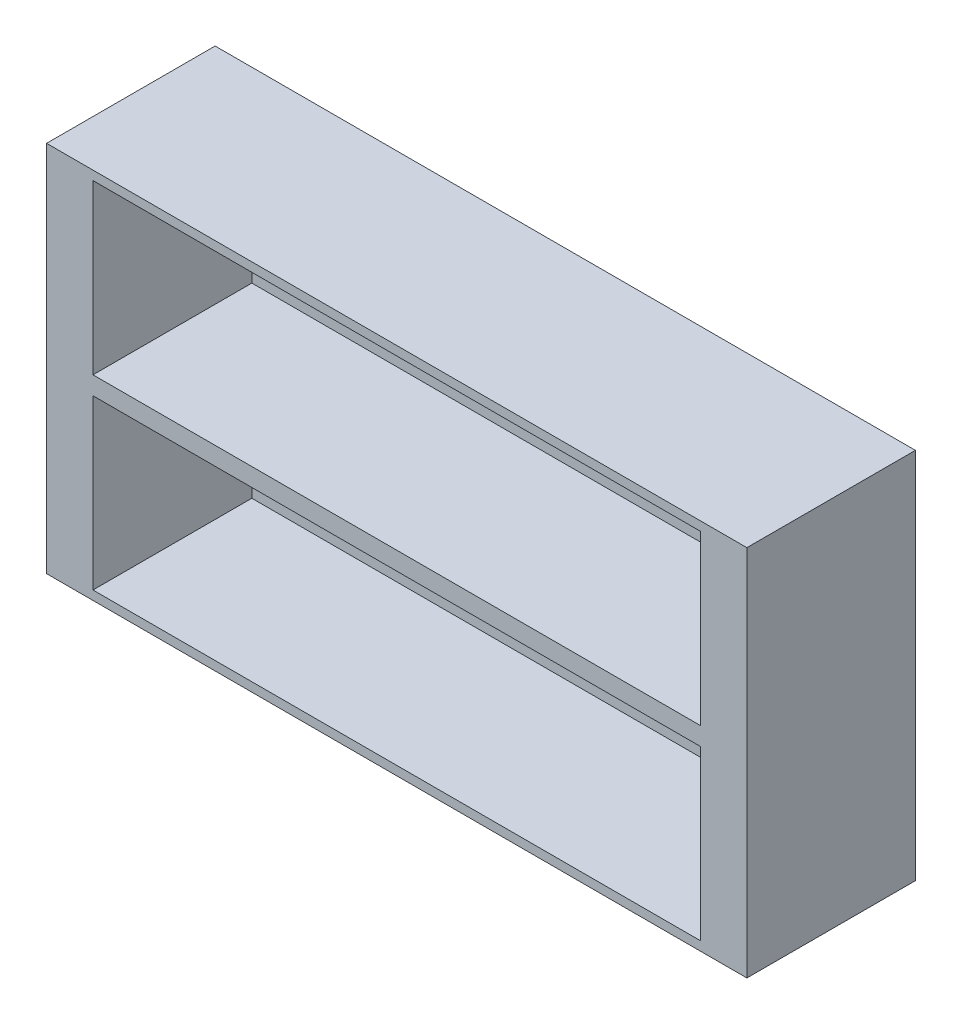
ISO-10303-21;
HEADER;
FILE_DESCRIPTION(('STEP AP214'),'2;1');
FILE_NAME('part.step','',(''),(''),'','','');
FILE_SCHEMA(('AUTOMOTIVE_DESIGN { 1 0 10303 214 1 1 1 1 }'));
ENDSEC;
DATA;
#1=APPLICATION_CONTEXT('core data for automotive mechanical design processes');
#2=APPLICATION_PROTOCOL_DEFINITION('international standard','automotive_design',2000,#1);
#3=PRODUCT_CONTEXT('',#1,'mechanical');
#4=PRODUCT('Part','Part','',(#3));
#5=PRODUCT_RELATED_PRODUCT_CATEGORY('part','',(#4));
#6=PRODUCT_DEFINITION_FORMATION('','',#4);
#7=PRODUCT_DEFINITION_CONTEXT('part definition',#1,'design');
#8=PRODUCT_DEFINITION('design','',#6,#7);
#9=PRODUCT_DEFINITION_SHAPE('','',#8);
#10=(LENGTH_UNIT() NAMED_UNIT(*) SI_UNIT(.MILLI.,.METRE.));
#11=(NAMED_UNIT(*) PLANE_ANGLE_UNIT() SI_UNIT($,.RADIAN.));
#12=(NAMED_UNIT(*) SI_UNIT($,.STERADIAN.) SOLID_ANGLE_UNIT());
#13=UNCERTAINTY_MEASURE_WITH_UNIT(LENGTH_MEASURE(1.E-05),#10,'distance_accuracy_value','');
#14=(GEOMETRIC_REPRESENTATION_CONTEXT(3) GLOBAL_UNCERTAINTY_ASSIGNED_CONTEXT((#13)) GLOBAL_UNIT_ASSIGNED_CONTEXT((#10,
#11,#12)) REPRESENTATION_CONTEXT('',''));
#15=CARTESIAN_POINT('',(0.,0.,0.));
#16=DIRECTION('',(0.,0.,1.));
#17=DIRECTION('',(1.,0.,0.));
#18=AXIS2_PLACEMENT_3D('',#15,#16,#17);
#19=CARTESIAN_POINT('',(0.,9.9695,0.));
#20=DIRECTION('',(0.,0.,1.));
#21=DIRECTION('',(1.,0.,0.));
#22=AXIS2_PLACEMENT_3D('',#19,#20,#21);
#23=CYLINDRICAL_SURFACE('',#22,1.5);
#24=CARTESIAN_POINT('',(0.,9.9695,0.));
#25=DIRECTION('',(0.,0.,1.));
#26=DIRECTION('',(-1.,0.,0.));
#27=AXIS2_PLACEMENT_3D('',#24,#25,#26);
#28=CIRCLE('',#27,1.5);
#29=CARTESIAN_POINT('',(-1.5,9.9695,0.));
#30=VERTEX_POINT('',#29);
#31=EDGE_CURVE('E199',#30,#30,#28,.T.);
#32=ORIENTED_EDGE('',*,*,#31,.F.);
#33=EDGE_LOOP('',(#32));
#34=FACE_BOUND('',#33,.T.);
#35=CARTESIAN_POINT('',(0.,9.9695,1.034));
#36=DIRECTION('',(0.,0.,1.));
#37=DIRECTION('',(1.,0.,0.));
#38=AXIS2_PLACEMENT_3D('',#35,#36,#37);
#39=CIRCLE('',#38,1.5);
#40=CARTESIAN_POINT('',(1.5,9.9695,1.034));
#41=VERTEX_POINT('',#40);
#42=EDGE_CURVE('E38',#41,#41,#39,.F.);
#43=ORIENTED_EDGE('',*,*,#42,.F.);
#44=EDGE_LOOP('',(#43));
#45=FACE_BOUND('',#44,.T.);
#46=ADVANCED_FACE('F34',(#34,#45),#23,.F.);
#47=CARTESIAN_POINT('',(37.465,-19.939,18.034));
#48=DIRECTION('',(-1.,0.,0.));
#49=DIRECTION('',(0.,0.,1.));
#50=AXIS2_PLACEMENT_3D('',#47,#48,#49);
#51=PLANE('',#50);
#52=DIRECTION('',(0.,1.,0.));
#53=VECTOR('',#52,1.);
#54=CARTESIAN_POINT('',(37.465,-19.939,0.));
#55=LINE('',#54,#53);
#56=CARTESIAN_POINT('',(37.465,-19.939,0.));
#57=VERTEX_POINT('',#56);
#58=CARTESIAN_POINT('',(37.465,19.939,0.));
#59=VERTEX_POINT('',#58);
#60=EDGE_CURVE('E198',#57,#59,#55,.T.);
#61=ORIENTED_EDGE('',*,*,#60,.T.);
#62=DIRECTION('',(0.,0.,-1.));
#63=VECTOR('',#62,1.);
#64=CARTESIAN_POINT('',(37.465,19.939,18.034));
#65=LINE('',#64,#63);
#66=CARTESIAN_POINT('',(37.465,19.939,18.034));
#67=VERTEX_POINT('',#66);
#68=EDGE_CURVE('E11',#67,#59,#65,.T.);
#69=ORIENTED_EDGE('',*,*,#68,.F.);
#70=DIRECTION('',(0.,1.,0.));
#71=VECTOR('',#70,1.);
#72=CARTESIAN_POINT('',(37.465,-19.939,18.034));
#73=LINE('',#72,#71);
#74=CARTESIAN_POINT('',(37.465,-19.939,18.034));
#75=VERTEX_POINT('',#74);
#76=EDGE_CURVE('E202',#75,#67,#73,.T.);
#77=ORIENTED_EDGE('',*,*,#76,.F.);
#78=DIRECTION('',(0.,0.,-1.));
#79=VECTOR('',#78,1.);
#80=CARTESIAN_POINT('',(37.465,-19.939,18.034));
#81=LINE('',#80,#79);
#82=EDGE_CURVE('E212',#75,#57,#81,.T.);
#83=ORIENTED_EDGE('',*,*,#82,.T.);
#84=EDGE_LOOP('',(#61,#69,#77,#83));
#85=FACE_BOUND('',#84,.T.);
#86=ADVANCED_FACE('F36',(#85),#51,.F.);
#87=CARTESIAN_POINT('',(-37.465,19.939,18.034));
#88=DIRECTION('',(0.,-1.,0.));
#89=DIRECTION('',(0.,0.,-1.));
#90=AXIS2_PLACEMENT_3D('',#87,#88,#89);
#91=PLANE('',#90);
#92=DIRECTION('',(-1.,0.,0.));
#93=VECTOR('',#92,1.);
#94=CARTESIAN_POINT('',(-37.465,19.939,0.));
#95=LINE('',#94,#93);
#96=CARTESIAN_POINT('',(-37.465,19.939,0.));
#97=VERTEX_POINT('',#96);
#98=EDGE_CURVE('E215',#59,#97,#95,.T.);
#99=ORIENTED_EDGE('',*,*,#98,.T.);
#100=DIRECTION('',(0.,0.,-1.));
#101=VECTOR('',#100,1.);
#102=CARTESIAN_POINT('',(-37.465,19.939,18.034));
#103=LINE('',#102,#101);
#104=CARTESIAN_POINT('',(-37.465,19.939,18.034));
#105=VERTEX_POINT('',#104);
#106=EDGE_CURVE('E43',#105,#97,#103,.T.);
#107=ORIENTED_EDGE('',*,*,#106,.F.);
#108=DIRECTION('',(-1.,0.,0.));
#109=VECTOR('',#108,1.);
#110=CARTESIAN_POINT('',(-37.465,19.939,18.034));
#111=LINE('',#110,#109);
#112=EDGE_CURVE('E205',#67,#105,#111,.T.);
#113=ORIENTED_EDGE('',*,*,#112,.F.);
#114=ORIENTED_EDGE('',*,*,#68,.T.);
#115=EDGE_LOOP('',(#99,#107,#113,#114));
#116=FACE_BOUND('',#115,.T.);
#117=ADVANCED_FACE('F238',(#116),#91,.F.);
#118=CARTESIAN_POINT('',(-37.465,-19.939,18.034));
#119=DIRECTION('',(1.,0.,0.));
#120=DIRECTION('',(0.,0.,-1.));
#121=AXIS2_PLACEMENT_3D('',#118,#119,#120);
#122=PLANE('',#121);
#123=DIRECTION('',(0.,-1.,0.));
#124=VECTOR('',#123,1.);
#125=CARTESIAN_POINT('',(-37.465,-19.939,0.));
#126=LINE('',#125,#124);
#127=CARTESIAN_POINT('',(-37.465,-19.939,0.));
#128=VERTEX_POINT('',#127);
#129=EDGE_CURVE('E217',#97,#128,#126,.T.);
#130=ORIENTED_EDGE('',*,*,#129,.T.);
#131=DIRECTION('',(0.,0.,-1.));
#132=VECTOR('',#131,1.);
#133=CARTESIAN_POINT('',(-37.465,-19.939,18.034));
#134=LINE('',#133,#132);
#135=CARTESIAN_POINT('',(-37.465,-19.939,18.034));
#136=VERTEX_POINT('',#135);
#137=EDGE_CURVE('E222',#136,#128,#134,.T.);
#138=ORIENTED_EDGE('',*,*,#137,.F.);
#139=DIRECTION('',(0.,-1.,0.));
#140=VECTOR('',#139,1.);
#141=CARTESIAN_POINT('',(-37.465,-19.939,18.034));
#142=LINE('',#141,#140);
#143=EDGE_CURVE('E208',#105,#136,#142,.T.);
#144=ORIENTED_EDGE('',*,*,#143,.F.);
#145=ORIENTED_EDGE('',*,*,#106,.T.);
#146=EDGE_LOOP('',(#130,#138,#144,#145));
#147=FACE_BOUND('',#146,.T.);
#148=ADVANCED_FACE('F256',(#147),#122,.F.);
#149=CARTESIAN_POINT('',(-37.465,-19.939,18.034));
#150=DIRECTION('',(0.,1.,0.));
#151=DIRECTION('',(0.,0.,1.));
#152=AXIS2_PLACEMENT_3D('',#149,#150,#151);
#153=PLANE('',#152);
#154=DIRECTION('',(1.,0.,0.));
#155=VECTOR('',#154,1.);
#156=CARTESIAN_POINT('',(-37.465,-19.939,0.));
#157=LINE('',#156,#155);
#158=EDGE_CURVE('E206',#128,#57,#157,.T.);
#159=ORIENTED_EDGE('',*,*,#158,.T.);
#160=ORIENTED_EDGE('',*,*,#82,.F.);
#161=DIRECTION('',(1.,0.,0.));
#162=VECTOR('',#161,1.);
#163=CARTESIAN_POINT('',(-37.465,-19.939,18.034));
#164=LINE('',#163,#162);
#165=EDGE_CURVE('E210',#136,#75,#164,.T.);
#166=ORIENTED_EDGE('',*,*,#165,.F.);
#167=ORIENTED_EDGE('',*,*,#137,.T.);
#168=EDGE_LOOP('',(#159,#160,#166,#167));
#169=FACE_BOUND('',#168,.T.);
#170=ADVANCED_FACE('F249',(#169),#153,.F.);
#171=CARTESIAN_POINT('',(0.,0.,18.034));
#172=DIRECTION('',(0.,0.,-1.));
#173=DIRECTION('',(-1.,0.,0.));
#174=AXIS2_PLACEMENT_3D('',#171,#172,#173);
#175=PLANE('',#174);
#176=DIRECTION('',(1.,0.,0.));
#177=VECTOR('',#176,1.);
#178=CARTESIAN_POINT('',(32.5,0.969500000000008,18.034));
#179=LINE('',#178,#177);
#180=CARTESIAN_POINT('',(-32.5,0.9695,18.034));
#181=VERTEX_POINT('',#180);
#182=CARTESIAN_POINT('',(32.5,0.969500000000008,18.034));
#183=VERTEX_POINT('',#182);
#184=EDGE_CURVE('E155',#181,#183,#179,.T.);
#185=ORIENTED_EDGE('',*,*,#184,.F.);
#186=DIRECTION('',(0.,-1.,0.));
#187=VECTOR('',#186,1.);
#188=CARTESIAN_POINT('',(-32.5,0.9695,18.034));
#189=LINE('',#188,#187);
#190=CARTESIAN_POINT('',(-32.5,18.9695,18.034));
#191=VERTEX_POINT('',#190);
#192=EDGE_CURVE('E51',#191,#181,#189,.T.);
#193=ORIENTED_EDGE('',*,*,#192,.F.);
#194=DIRECTION('',(-1.,0.,0.));
#195=VECTOR('',#194,1.);
#196=CARTESIAN_POINT('',(32.5,18.9695,18.034));
#197=LINE('',#196,#195);
#198=CARTESIAN_POINT('',(32.5,18.9695,18.034));
#199=VERTEX_POINT('',#198);
#200=EDGE_CURVE('E146',#199,#191,#197,.T.);
#201=ORIENTED_EDGE('',*,*,#200,.F.);
#202=DIRECTION('',(0.,1.,0.));
#203=VECTOR('',#202,1.);
#204=CARTESIAN_POINT('',(32.5,0.969500000000008,18.034));
#205=LINE('',#204,#203);
#206=EDGE_CURVE('E149',#183,#199,#205,.T.);
#207=ORIENTED_EDGE('',*,*,#206,.F.);
#208=EDGE_LOOP('',(#185,#193,#201,#207));
#209=FACE_BOUND('',#208,.T.);
#210=DIRECTION('',(-1.,0.,0.));
#211=VECTOR('',#210,1.);
#212=CARTESIAN_POINT('',(32.5,-0.969500000000008,18.034));
#213=LINE('',#212,#211);
#214=CARTESIAN_POINT('',(32.5,-0.969500000000008,18.034));
#215=VERTEX_POINT('',#214);
#216=CARTESIAN_POINT('',(-32.5,-0.9695,18.034));
#217=VERTEX_POINT('',#216);
#218=EDGE_CURVE('E181',#215,#217,#213,.T.);
#219=ORIENTED_EDGE('',*,*,#218,.F.);
#220=DIRECTION('',(0.,1.,0.));
#221=VECTOR('',#220,1.);
#222=CARTESIAN_POINT('',(32.5,-0.969500000000008,18.034));
#223=LINE('',#222,#221);
#224=CARTESIAN_POINT('',(32.5,-18.9695,18.034));
#225=VERTEX_POINT('',#224);
#226=EDGE_CURVE('E59',#225,#215,#223,.T.);
#227=ORIENTED_EDGE('',*,*,#226,.F.);
#228=DIRECTION('',(1.,0.,0.));
#229=VECTOR('',#228,1.);
#230=CARTESIAN_POINT('',(32.5,-18.9695,18.034));
#231=LINE('',#230,#229);
#232=CARTESIAN_POINT('',(-32.5,-18.9695,18.034));
#233=VERTEX_POINT('',#232);
#234=EDGE_CURVE('E170',#233,#225,#231,.T.);
#235=ORIENTED_EDGE('',*,*,#234,.F.);
#236=DIRECTION('',(0.,-1.,0.));
#237=VECTOR('',#236,1.);
#238=CARTESIAN_POINT('',(-32.5,-0.9695,18.034));
#239=LINE('',#238,#237);
#240=EDGE_CURVE('E184',#217,#233,#239,.T.);
#241=ORIENTED_EDGE('',*,*,#240,.F.);
#242=EDGE_LOOP('',(#219,#227,#235,#241));
#243=FACE_BOUND('',#242,.T.);
#244=ORIENTED_EDGE('',*,*,#76,.T.);
#245=ORIENTED_EDGE('',*,*,#112,.T.);
#246=ORIENTED_EDGE('',*,*,#143,.T.);
#247=ORIENTED_EDGE('',*,*,#165,.T.);
#248=EDGE_LOOP('',(#244,#245,#246,#247));
#249=FACE_BOUND('',#248,.T.);
#250=ADVANCED_FACE('F245',(#209,#243,#249),#175,.F.);
#251=CARTESIAN_POINT('',(0.,0.,0.));
#252=DIRECTION('',(0.,0.,-1.));
#253=DIRECTION('',(-1.,0.,0.));
#254=AXIS2_PLACEMENT_3D('',#251,#252,#253);
#255=PLANE('',#254);
#256=CARTESIAN_POINT('',(0.,-9.9695,0.));
#257=DIRECTION('',(0.,0.,1.));
#258=DIRECTION('',(1.,0.,0.));
#259=AXIS2_PLACEMENT_3D('',#256,#257,#258);
#260=CIRCLE('',#259,1.5);
#261=CARTESIAN_POINT('',(1.5,-9.9695,0.));
#262=VERTEX_POINT('',#261);
#263=EDGE_CURVE('E195',#262,#262,#260,.T.);
#264=ORIENTED_EDGE('',*,*,#263,.T.);
#265=EDGE_LOOP('',(#264));
#266=FACE_BOUND('',#265,.T.);
#267=ORIENTED_EDGE('',*,*,#31,.T.);
#268=EDGE_LOOP('',(#267));
#269=FACE_BOUND('',#268,.T.);
#270=ORIENTED_EDGE('',*,*,#60,.F.);
#271=ORIENTED_EDGE('',*,*,#158,.F.);
#272=ORIENTED_EDGE('',*,*,#129,.F.);
#273=ORIENTED_EDGE('',*,*,#98,.F.);
#274=EDGE_LOOP('',(#270,#271,#272,#273));
#275=FACE_BOUND('',#274,.T.);
#276=ADVANCED_FACE('F248',(#266,#269,#275),#255,.T.);
#277=CARTESIAN_POINT('',(0.,-9.9695,0.));
#278=DIRECTION('',(0.,0.,1.));
#279=DIRECTION('',(1.,0.,0.));
#280=AXIS2_PLACEMENT_3D('',#277,#278,#279);
#281=CYLINDRICAL_SURFACE('',#280,1.5);
#282=CARTESIAN_POINT('',(0.,-9.9695,1.034));
#283=DIRECTION('',(0.,0.,-1.));
#284=DIRECTION('',(-1.,0.,0.));
#285=AXIS2_PLACEMENT_3D('',#282,#283,#284);
#286=CIRCLE('',#285,1.5);
#287=CARTESIAN_POINT('',(-1.5,-9.9695,1.034));
#288=VERTEX_POINT('',#287);
#289=EDGE_CURVE('E162',#288,#288,#286,.F.);
#290=ORIENTED_EDGE('',*,*,#289,.T.);
#291=EDGE_LOOP('',(#290));
#292=FACE_BOUND('',#291,.T.);
#293=ORIENTED_EDGE('',*,*,#263,.F.);
#294=EDGE_LOOP('',(#293));
#295=FACE_BOUND('',#294,.T.);
#296=ADVANCED_FACE('F243',(#292,#295),#281,.F.);
#297=CARTESIAN_POINT('',(0.,0.,1.034));
#298=DIRECTION('',(0.,0.,-1.));
#299=DIRECTION('',(-1.,0.,0.));
#300=AXIS2_PLACEMENT_3D('',#297,#298,#299);
#301=PLANE('',#300);
#302=DIRECTION('',(0.,1.,0.));
#303=VECTOR('',#302,1.);
#304=CARTESIAN_POINT('',(32.5,-0.969500000000008,1.034));
#305=LINE('',#304,#303);
#306=CARTESIAN_POINT('',(32.5,-18.9695,1.034));
#307=VERTEX_POINT('',#306);
#308=CARTESIAN_POINT('',(32.5,-0.969500000000008,1.034));
#309=VERTEX_POINT('',#308);
#310=EDGE_CURVE('E166',#307,#309,#305,.T.);
#311=ORIENTED_EDGE('',*,*,#310,.T.);
#312=DIRECTION('',(-1.,0.,0.));
#313=VECTOR('',#312,1.);
#314=CARTESIAN_POINT('',(32.5,-0.969500000000008,1.034));
#315=LINE('',#314,#313);
#316=CARTESIAN_POINT('',(-32.5,-0.9695,1.034));
#317=VERTEX_POINT('',#316);
#318=EDGE_CURVE('E169',#309,#317,#315,.T.);
#319=ORIENTED_EDGE('',*,*,#318,.T.);
#320=DIRECTION('',(0.,-1.,0.));
#321=VECTOR('',#320,1.);
#322=CARTESIAN_POINT('',(-32.5,-0.9695,1.034));
#323=LINE('',#322,#321);
#324=CARTESIAN_POINT('',(-32.5,-18.9695,1.034));
#325=VERTEX_POINT('',#324);
#326=EDGE_CURVE('E173',#317,#325,#323,.T.);
#327=ORIENTED_EDGE('',*,*,#326,.T.);
#328=DIRECTION('',(1.,0.,0.));
#329=VECTOR('',#328,1.);
#330=CARTESIAN_POINT('',(32.5,-18.9695,1.034));
#331=LINE('',#330,#329);
#332=EDGE_CURVE('E176',#325,#307,#331,.T.);
#333=ORIENTED_EDGE('',*,*,#332,.T.);
#334=EDGE_LOOP('',(#311,#319,#327,#333));
#335=FACE_BOUND('',#334,.T.);
#336=ORIENTED_EDGE('',*,*,#289,.F.);
#337=EDGE_LOOP('',(#336));
#338=FACE_BOUND('',#337,.T.);
#339=ADVANCED_FACE('F300',(#335,#338),#301,.F.);
#340=CARTESIAN_POINT('',(32.5,-0.969500000000008,1.034));
#341=DIRECTION('',(1.,0.,0.));
#342=DIRECTION('',(0.,0.,-1.));
#343=AXIS2_PLACEMENT_3D('',#340,#341,#342);
#344=PLANE('',#343);
#345=ORIENTED_EDGE('',*,*,#226,.T.);
#346=DIRECTION('',(0.,0.,1.));
#347=VECTOR('',#346,1.);
#348=CARTESIAN_POINT('',(32.5,-0.969500000000008,1.034));
#349=LINE('',#348,#347);
#350=EDGE_CURVE('E179',#309,#215,#349,.T.);
#351=ORIENTED_EDGE('',*,*,#350,.F.);
#352=ORIENTED_EDGE('',*,*,#310,.F.);
#353=DIRECTION('',(0.,0.,1.));
#354=VECTOR('',#353,1.);
#355=CARTESIAN_POINT('',(32.5,-18.9695,1.034));
#356=LINE('',#355,#354);
#357=EDGE_CURVE('E156',#307,#225,#356,.T.);
#358=ORIENTED_EDGE('',*,*,#357,.T.);
#359=EDGE_LOOP('',(#345,#351,#352,#358));
#360=FACE_BOUND('',#359,.T.);
#361=ADVANCED_FACE('F306',(#360),#344,.F.);
#362=CARTESIAN_POINT('',(32.5,-18.9695,1.034));
#363=DIRECTION('',(0.,-1.,0.));
#364=DIRECTION('',(1.,0.,0.));
#365=AXIS2_PLACEMENT_3D('',#362,#363,#364);
#366=PLANE('',#365);
#367=ORIENTED_EDGE('',*,*,#234,.T.);
#368=ORIENTED_EDGE('',*,*,#357,.F.);
#369=ORIENTED_EDGE('',*,*,#332,.F.);
#370=DIRECTION('',(0.,0.,1.));
#371=VECTOR('',#370,1.);
#372=CARTESIAN_POINT('',(-32.5,-18.9695,1.034));
#373=LINE('',#372,#371);
#374=EDGE_CURVE('E190',#325,#233,#373,.T.);
#375=ORIENTED_EDGE('',*,*,#374,.T.);
#376=EDGE_LOOP('',(#367,#368,#369,#375));
#377=FACE_BOUND('',#376,.T.);
#378=ADVANCED_FACE('F314',(#377),#366,.F.);
#379=CARTESIAN_POINT('',(-32.5,-0.9695,1.034));
#380=DIRECTION('',(-1.,0.,0.));
#381=DIRECTION('',(0.,0.,1.));
#382=AXIS2_PLACEMENT_3D('',#379,#380,#381);
#383=PLANE('',#382);
#384=ORIENTED_EDGE('',*,*,#240,.T.);
#385=ORIENTED_EDGE('',*,*,#374,.F.);
#386=ORIENTED_EDGE('',*,*,#326,.F.);
#387=DIRECTION('',(0.,0.,1.));
#388=VECTOR('',#387,1.);
#389=CARTESIAN_POINT('',(-32.5,-0.9695,1.034));
#390=LINE('',#389,#388);
#391=EDGE_CURVE('E192',#317,#217,#390,.T.);
#392=ORIENTED_EDGE('',*,*,#391,.T.);
#393=EDGE_LOOP('',(#384,#385,#386,#392));
#394=FACE_BOUND('',#393,.T.);
#395=ADVANCED_FACE('F320',(#394),#383,.F.);
#396=CARTESIAN_POINT('',(32.5,-0.969500000000008,1.034));
#397=DIRECTION('',(0.,1.,0.));
#398=DIRECTION('',(-1.,0.,0.));
#399=AXIS2_PLACEMENT_3D('',#396,#397,#398);
#400=PLANE('',#399);
#401=ORIENTED_EDGE('',*,*,#218,.T.);
#402=ORIENTED_EDGE('',*,*,#391,.F.);
#403=ORIENTED_EDGE('',*,*,#318,.F.);
#404=ORIENTED_EDGE('',*,*,#350,.T.);
#405=EDGE_LOOP('',(#401,#402,#403,#404));
#406=FACE_BOUND('',#405,.T.);
#407=ADVANCED_FACE('F328',(#406),#400,.F.);
#408=CARTESIAN_POINT('',(0.,0.,1.034));
#409=DIRECTION('',(0.,0.,1.));
#410=DIRECTION('',(1.,0.,0.));
#411=AXIS2_PLACEMENT_3D('',#408,#409,#410);
#412=PLANE('',#411);
#413=DIRECTION('',(0.,-1.,0.));
#414=VECTOR('',#413,1.);
#415=CARTESIAN_POINT('',(-32.5,0.9695,1.034));
#416=LINE('',#415,#414);
#417=CARTESIAN_POINT('',(-32.5,18.9695,1.034));
#418=VERTEX_POINT('',#417);
#419=CARTESIAN_POINT('',(-32.5,0.9695,1.034));
#420=VERTEX_POINT('',#419);
#421=EDGE_CURVE('E127',#418,#420,#416,.T.);
#422=ORIENTED_EDGE('',*,*,#421,.T.);
#423=DIRECTION('',(1.,0.,0.));
#424=VECTOR('',#423,1.);
#425=CARTESIAN_POINT('',(32.5,0.969500000000008,1.034));
#426=LINE('',#425,#424);
#427=CARTESIAN_POINT('',(32.5,0.969500000000008,1.034));
#428=VERTEX_POINT('',#427);
#429=EDGE_CURVE('E136',#420,#428,#426,.T.);
#430=ORIENTED_EDGE('',*,*,#429,.T.);
#431=DIRECTION('',(0.,1.,0.));
#432=VECTOR('',#431,1.);
#433=CARTESIAN_POINT('',(32.5,0.969500000000008,1.034));
#434=LINE('',#433,#432);
#435=CARTESIAN_POINT('',(32.5,18.9695,1.034));
#436=VERTEX_POINT('',#435);
#437=EDGE_CURVE('E141',#428,#436,#434,.T.);
#438=ORIENTED_EDGE('',*,*,#437,.T.);
#439=DIRECTION('',(-1.,0.,0.));
#440=VECTOR('',#439,1.);
#441=CARTESIAN_POINT('',(32.5,18.9695,1.034));
#442=LINE('',#441,#440);
#443=EDGE_CURVE('E133',#436,#418,#442,.T.);
#444=ORIENTED_EDGE('',*,*,#443,.T.);
#445=EDGE_LOOP('',(#422,#430,#438,#444));
#446=FACE_BOUND('',#445,.T.);
#447=ORIENTED_EDGE('',*,*,#42,.T.);
#448=EDGE_LOOP('',(#447));
#449=FACE_BOUND('',#448,.T.);
#450=ADVANCED_FACE('F143',(#446,#449),#412,.T.);
#451=CARTESIAN_POINT('',(-32.5,0.9695,1.034));
#452=DIRECTION('',(-1.,0.,0.));
#453=DIRECTION('',(0.,0.,1.));
#454=AXIS2_PLACEMENT_3D('',#451,#452,#453);
#455=PLANE('',#454);
#456=ORIENTED_EDGE('',*,*,#192,.T.);
#457=DIRECTION('',(0.,0.,1.));
#458=VECTOR('',#457,1.);
#459=CARTESIAN_POINT('',(-32.5,0.9695,1.034));
#460=LINE('',#459,#458);
#461=EDGE_CURVE('E123',#420,#181,#460,.T.);
#462=ORIENTED_EDGE('',*,*,#461,.F.);
#463=ORIENTED_EDGE('',*,*,#421,.F.);
#464=DIRECTION('',(0.,0.,1.));
#465=VECTOR('',#464,1.);
#466=CARTESIAN_POINT('',(-32.5,18.9695,1.034));
#467=LINE('',#466,#465);
#468=EDGE_CURVE('E160',#418,#191,#467,.T.);
#469=ORIENTED_EDGE('',*,*,#468,.T.);
#470=EDGE_LOOP('',(#456,#462,#463,#469));
#471=FACE_BOUND('',#470,.T.);
#472=ADVANCED_FACE('F125',(#471),#455,.F.);
#473=CARTESIAN_POINT('',(32.5,18.9695,1.034));
#474=DIRECTION('',(0.,1.,0.));
#475=DIRECTION('',(-1.,0.,0.));
#476=AXIS2_PLACEMENT_3D('',#473,#474,#475);
#477=PLANE('',#476);
#478=ORIENTED_EDGE('',*,*,#200,.T.);
#479=ORIENTED_EDGE('',*,*,#468,.F.);
#480=ORIENTED_EDGE('',*,*,#443,.F.);
#481=DIRECTION('',(0.,0.,1.));
#482=VECTOR('',#481,1.);
#483=CARTESIAN_POINT('',(32.5,18.9695,1.034));
#484=LINE('',#483,#482);
#485=EDGE_CURVE('E163',#436,#199,#484,.T.);
#486=ORIENTED_EDGE('',*,*,#485,.T.);
#487=EDGE_LOOP('',(#478,#479,#480,#486));
#488=FACE_BOUND('',#487,.T.);
#489=ADVANCED_FACE('F349',(#488),#477,.F.);
#490=CARTESIAN_POINT('',(32.5,0.969500000000008,1.034));
#491=DIRECTION('',(1.,0.,0.));
#492=DIRECTION('',(0.,0.,-1.));
#493=AXIS2_PLACEMENT_3D('',#490,#491,#492);
#494=PLANE('',#493);
#495=ORIENTED_EDGE('',*,*,#206,.T.);
#496=ORIENTED_EDGE('',*,*,#485,.F.);
#497=ORIENTED_EDGE('',*,*,#437,.F.);
#498=DIRECTION('',(0.,0.,1.));
#499=VECTOR('',#498,1.);
#500=CARTESIAN_POINT('',(32.5,0.969500000000008,1.034));
#501=LINE('',#500,#499);
#502=EDGE_CURVE('E132',#428,#183,#501,.T.);
#503=ORIENTED_EDGE('',*,*,#502,.T.);
#504=EDGE_LOOP('',(#495,#496,#497,#503));
#505=FACE_BOUND('',#504,.T.);
#506=ADVANCED_FACE('F356',(#505),#494,.F.);
#507=CARTESIAN_POINT('',(32.5,0.969500000000008,1.034));
#508=DIRECTION('',(0.,-1.,0.));
#509=DIRECTION('',(1.,0.,0.));
#510=AXIS2_PLACEMENT_3D('',#507,#508,#509);
#511=PLANE('',#510);
#512=ORIENTED_EDGE('',*,*,#184,.T.);
#513=ORIENTED_EDGE('',*,*,#502,.F.);
#514=ORIENTED_EDGE('',*,*,#429,.F.);
#515=ORIENTED_EDGE('',*,*,#461,.T.);
#516=EDGE_LOOP('',(#512,#513,#514,#515));
#517=FACE_BOUND('',#516,.T.);
#518=ADVANCED_FACE('F137',(#517),#511,.F.);
#519=CLOSED_SHELL('',(#46,#86,#117,#148,#170,#250,#276,#296,#339,#361,#378,#395,#407,#450,#472,
#489,#506,#518));
#520=MANIFOLD_SOLID_BREP('B2',#519);
#521=ADVANCED_BREP_SHAPE_REPRESENTATION('',(#18,#520),#14);
#522=SHAPE_DEFINITION_REPRESENTATION(#9,#521);
ENDSEC;
END-ISO-10303-21;
